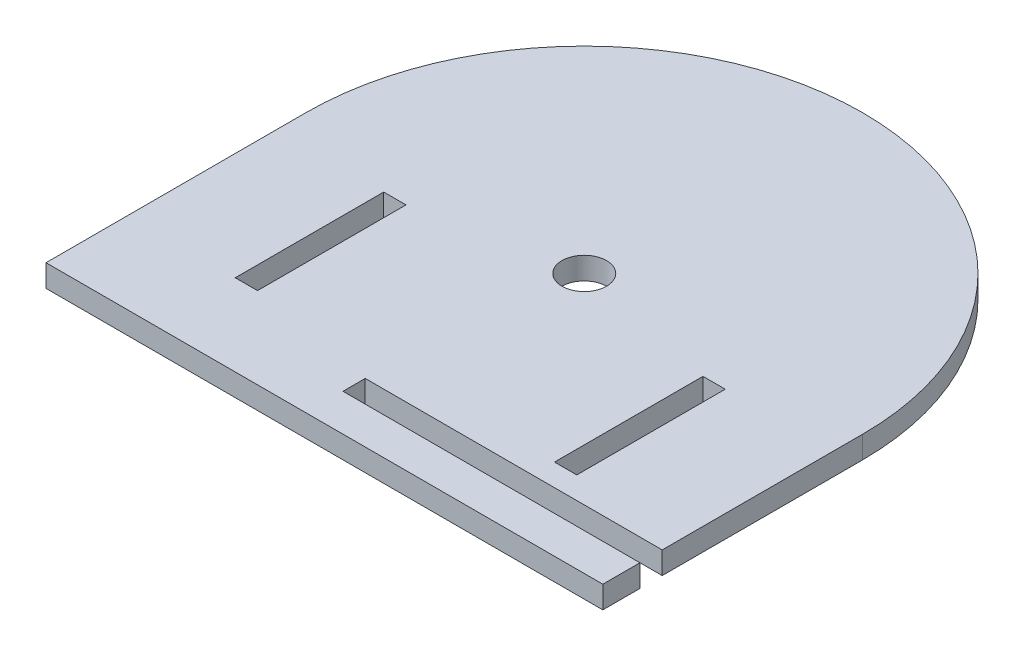
ISO-10303-21;
HEADER;
FILE_DESCRIPTION(('STEP AP214'),'2;1');
FILE_NAME('part.step','',(''),(''),'','','');
FILE_SCHEMA(('AUTOMOTIVE_DESIGN { 1 0 10303 214 1 1 1 1 }'));
ENDSEC;
DATA;
#1=APPLICATION_CONTEXT('core data for automotive mechanical design processes');
#2=APPLICATION_PROTOCOL_DEFINITION('international standard','automotive_design',2000,#1);
#3=PRODUCT_CONTEXT('',#1,'mechanical');
#4=PRODUCT('Part','Part','',(#3));
#5=PRODUCT_RELATED_PRODUCT_CATEGORY('part','',(#4));
#6=PRODUCT_DEFINITION_FORMATION('','',#4);
#7=PRODUCT_DEFINITION_CONTEXT('part definition',#1,'design');
#8=PRODUCT_DEFINITION('design','',#6,#7);
#9=PRODUCT_DEFINITION_SHAPE('','',#8);
#10=(LENGTH_UNIT() NAMED_UNIT(*) SI_UNIT(.MILLI.,.METRE.));
#11=(NAMED_UNIT(*) PLANE_ANGLE_UNIT() SI_UNIT($,.RADIAN.));
#12=(NAMED_UNIT(*) SI_UNIT($,.STERADIAN.) SOLID_ANGLE_UNIT());
#13=UNCERTAINTY_MEASURE_WITH_UNIT(LENGTH_MEASURE(1.E-05),#10,'distance_accuracy_value','');
#14=(GEOMETRIC_REPRESENTATION_CONTEXT(3) GLOBAL_UNCERTAINTY_ASSIGNED_CONTEXT((#13)) GLOBAL_UNIT_ASSIGNED_CONTEXT((#10,
#11,#12)) REPRESENTATION_CONTEXT('',''));
#15=CARTESIAN_POINT('',(0.,0.,0.));
#16=DIRECTION('',(0.,0.,1.));
#17=DIRECTION('',(1.,0.,0.));
#18=AXIS2_PLACEMENT_3D('',#15,#16,#17);
#19=CARTESIAN_POINT('',(0.,3.,-10.9892005622044));
#20=DIRECTION('',(0.,0.,1.));
#21=DIRECTION('',(1.,0.,0.));
#22=AXIS2_PLACEMENT_3D('',#19,#20,#21);
#23=PLANE('',#22);
#24=DIRECTION('',(-1.,0.,0.));
#25=VECTOR('',#24,1.);
#26=CARTESIAN_POINT('',(0.,0.,-10.9892005622044));
#27=LINE('',#26,#25);
#28=CARTESIAN_POINT('',(130.5,0.,-10.9892005622044));
#29=VERTEX_POINT('',#28);
#30=CARTESIAN_POINT('',(127.5,0.,-10.9892005622044));
#31=VERTEX_POINT('',#30);
#32=EDGE_CURVE('E239',#29,#31,#27,.T.);
#33=ORIENTED_EDGE('',*,*,#32,.T.);
#34=DIRECTION('',(0.,-1.,0.));
#35=VECTOR('',#34,1.);
#36=CARTESIAN_POINT('',(127.5,3.,-10.9892005622044));
#37=LINE('',#36,#35);
#38=CARTESIAN_POINT('',(127.5,3.,-10.9892005622044));
#39=VERTEX_POINT('',#38);
#40=EDGE_CURVE('E11',#39,#31,#37,.T.);
#41=ORIENTED_EDGE('',*,*,#40,.F.);
#42=DIRECTION('',(-1.,0.,0.));
#43=VECTOR('',#42,1.);
#44=CARTESIAN_POINT('',(0.,3.,-10.9892005622044));
#45=LINE('',#44,#43);
#46=CARTESIAN_POINT('',(130.5,3.,-10.9892005622044));
#47=VERTEX_POINT('',#46);
#48=EDGE_CURVE('E169',#47,#39,#45,.T.);
#49=ORIENTED_EDGE('',*,*,#48,.F.);
#50=DIRECTION('',(0.,-1.,0.));
#51=VECTOR('',#50,1.);
#52=CARTESIAN_POINT('',(130.5,3.,-10.9892005622044));
#53=LINE('',#52,#51);
#54=EDGE_CURVE('E250',#47,#29,#53,.T.);
#55=ORIENTED_EDGE('',*,*,#54,.T.);
#56=EDGE_LOOP('',(#33,#41,#49,#55));
#57=FACE_BOUND('',#56,.T.);
#58=ADVANCED_FACE('F39',(#57),#23,.F.);
#59=CARTESIAN_POINT('',(127.5,3.,0.));
#60=DIRECTION('',(-1.,0.,0.));
#61=DIRECTION('',(0.,0.,1.));
#62=AXIS2_PLACEMENT_3D('',#59,#60,#61);
#63=PLANE('',#62);
#64=DIRECTION('',(0.,0.,-1.));
#65=VECTOR('',#64,1.);
#66=CARTESIAN_POINT('',(127.5,0.,0.));
#67=LINE('',#66,#65);
#68=CARTESIAN_POINT('',(127.5,0.,-30.9892005622044));
#69=VERTEX_POINT('',#68);
#70=EDGE_CURVE('E175',#31,#69,#67,.T.);
#71=ORIENTED_EDGE('',*,*,#70,.T.);
#72=DIRECTION('',(0.,-1.,0.));
#73=VECTOR('',#72,1.);
#74=CARTESIAN_POINT('',(127.5,3.,-30.9892005622044));
#75=LINE('',#74,#73);
#76=CARTESIAN_POINT('',(127.5,3.,-30.9892005622044));
#77=VERTEX_POINT('',#76);
#78=EDGE_CURVE('E50',#77,#69,#75,.T.);
#79=ORIENTED_EDGE('',*,*,#78,.F.);
#80=DIRECTION('',(0.,0.,-1.));
#81=VECTOR('',#80,1.);
#82=CARTESIAN_POINT('',(127.5,3.,0.));
#83=LINE('',#82,#81);
#84=EDGE_CURVE('E163',#39,#77,#83,.T.);
#85=ORIENTED_EDGE('',*,*,#84,.F.);
#86=ORIENTED_EDGE('',*,*,#40,.T.);
#87=EDGE_LOOP('',(#71,#79,#85,#86));
#88=FACE_BOUND('',#87,.T.);
#89=ADVANCED_FACE('F174',(#88),#63,.F.);
#90=CARTESIAN_POINT('',(0.,3.,-30.9892005622044));
#91=DIRECTION('',(0.,0.,-1.));
#92=DIRECTION('',(-1.,0.,0.));
#93=AXIS2_PLACEMENT_3D('',#90,#91,#92);
#94=PLANE('',#93);
#95=DIRECTION('',(1.,0.,0.));
#96=VECTOR('',#95,1.);
#97=CARTESIAN_POINT('',(0.,0.,-30.9892005622044));
#98=LINE('',#97,#96);
#99=CARTESIAN_POINT('',(130.5,0.,-30.9892005622044));
#100=VERTEX_POINT('',#99);
#101=EDGE_CURVE('E112',#69,#100,#98,.T.);
#102=ORIENTED_EDGE('',*,*,#101,.T.);
#103=DIRECTION('',(0.,-1.,0.));
#104=VECTOR('',#103,1.);
#105=CARTESIAN_POINT('',(130.5,3.,-30.9892005622044));
#106=LINE('',#105,#104);
#107=CARTESIAN_POINT('',(130.5,3.,-30.9892005622044));
#108=VERTEX_POINT('',#107);
#109=EDGE_CURVE('E177',#108,#100,#106,.T.);
#110=ORIENTED_EDGE('',*,*,#109,.F.);
#111=DIRECTION('',(1.,0.,0.));
#112=VECTOR('',#111,1.);
#113=CARTESIAN_POINT('',(0.,3.,-30.9892005622044));
#114=LINE('',#113,#112);
#115=EDGE_CURVE('E167',#77,#108,#114,.T.);
#116=ORIENTED_EDGE('',*,*,#115,.F.);
#117=ORIENTED_EDGE('',*,*,#78,.T.);
#118=EDGE_LOOP('',(#102,#110,#116,#117));
#119=FACE_BOUND('',#118,.T.);
#120=ADVANCED_FACE('F179',(#119),#94,.F.);
#121=CARTESIAN_POINT('',(87.5,3.,0.));
#122=DIRECTION('',(-1.,0.,0.));
#123=DIRECTION('',(0.,0.,1.));
#124=AXIS2_PLACEMENT_3D('',#121,#122,#123);
#125=PLANE('',#124);
#126=DIRECTION('',(0.,0.,-1.));
#127=VECTOR('',#126,1.);
#128=CARTESIAN_POINT('',(87.5,0.,0.));
#129=LINE('',#128,#127);
#130=CARTESIAN_POINT('',(87.5,0.,-10.9892005622043));
#131=VERTEX_POINT('',#130);
#132=CARTESIAN_POINT('',(87.5,0.,-30.9892005622043));
#133=VERTEX_POINT('',#132);
#134=EDGE_CURVE('E223',#131,#133,#129,.T.);
#135=ORIENTED_EDGE('',*,*,#134,.F.);
#136=DIRECTION('',(0.,-1.,0.));
#137=VECTOR('',#136,1.);
#138=CARTESIAN_POINT('',(87.5,3.,-10.9892005622043));
#139=LINE('',#138,#137);
#140=CARTESIAN_POINT('',(87.5,3.,-10.9892005622043));
#141=VERTEX_POINT('',#140);
#142=EDGE_CURVE('E253',#141,#131,#139,.T.);
#143=ORIENTED_EDGE('',*,*,#142,.F.);
#144=DIRECTION('',(0.,0.,-1.));
#145=VECTOR('',#144,1.);
#146=CARTESIAN_POINT('',(87.5,3.,0.));
#147=LINE('',#146,#145);
#148=CARTESIAN_POINT('',(87.5,3.,-30.9892005622043));
#149=VERTEX_POINT('',#148);
#150=EDGE_CURVE('E534',#141,#149,#147,.T.);
#151=ORIENTED_EDGE('',*,*,#150,.T.);
#152=DIRECTION('',(0.,-1.,0.));
#153=VECTOR('',#152,1.);
#154=CARTESIAN_POINT('',(87.5,3.,-30.9892005622043));
#155=LINE('',#154,#153);
#156=EDGE_CURVE('E256',#149,#133,#155,.T.);
#157=ORIENTED_EDGE('',*,*,#156,.T.);
#158=EDGE_LOOP('',(#135,#143,#151,#157));
#159=FACE_BOUND('',#158,.T.);
#160=ADVANCED_FACE('F359',(#159),#125,.T.);
#161=CARTESIAN_POINT('',(0.,3.,-10.9892005622043));
#162=DIRECTION('',(0.,0.,-1.));
#163=DIRECTION('',(-1.,0.,0.));
#164=AXIS2_PLACEMENT_3D('',#161,#162,#163);
#165=PLANE('',#164);
#166=DIRECTION('',(1.,0.,0.));
#167=VECTOR('',#166,1.);
#168=CARTESIAN_POINT('',(0.,0.,-10.9892005622043));
#169=LINE('',#168,#167);
#170=CARTESIAN_POINT('',(84.5,0.,-10.9892005622043));
#171=VERTEX_POINT('',#170);
#172=EDGE_CURVE('E227',#171,#131,#169,.T.);
#173=ORIENTED_EDGE('',*,*,#172,.F.);
#174=DIRECTION('',(0.,-1.,0.));
#175=VECTOR('',#174,1.);
#176=CARTESIAN_POINT('',(84.5,3.,-10.9892005622043));
#177=LINE('',#176,#175);
#178=CARTESIAN_POINT('',(84.5,3.,-10.9892005622043));
#179=VERTEX_POINT('',#178);
#180=EDGE_CURVE('E262',#179,#171,#177,.T.);
#181=ORIENTED_EDGE('',*,*,#180,.F.);
#182=DIRECTION('',(1.,0.,0.));
#183=VECTOR('',#182,1.);
#184=CARTESIAN_POINT('',(0.,3.,-10.9892005622043));
#185=LINE('',#184,#183);
#186=EDGE_CURVE('E537',#179,#141,#185,.T.);
#187=ORIENTED_EDGE('',*,*,#186,.T.);
#188=ORIENTED_EDGE('',*,*,#142,.T.);
#189=EDGE_LOOP('',(#173,#181,#187,#188));
#190=FACE_BOUND('',#189,.T.);
#191=ADVANCED_FACE('F355',(#190),#165,.T.);
#192=CARTESIAN_POINT('',(84.5,3.,0.));
#193=DIRECTION('',(1.,0.,0.));
#194=DIRECTION('',(0.,0.,-1.));
#195=AXIS2_PLACEMENT_3D('',#192,#193,#194);
#196=PLANE('',#195);
#197=DIRECTION('',(0.,0.,1.));
#198=VECTOR('',#197,1.);
#199=CARTESIAN_POINT('',(84.5,0.,0.));
#200=LINE('',#199,#198);
#201=CARTESIAN_POINT('',(84.5,0.,-30.9892005622043));
#202=VERTEX_POINT('',#201);
#203=EDGE_CURVE('E231',#202,#171,#200,.T.);
#204=ORIENTED_EDGE('',*,*,#203,.F.);
#205=DIRECTION('',(0.,-1.,0.));
#206=VECTOR('',#205,1.);
#207=CARTESIAN_POINT('',(84.5,3.,-30.9892005622043));
#208=LINE('',#207,#206);
#209=CARTESIAN_POINT('',(84.5,3.,-30.9892005622043));
#210=VERTEX_POINT('',#209);
#211=EDGE_CURVE('E259',#210,#202,#208,.T.);
#212=ORIENTED_EDGE('',*,*,#211,.F.);
#213=DIRECTION('',(0.,0.,1.));
#214=VECTOR('',#213,1.);
#215=CARTESIAN_POINT('',(84.5,3.,0.));
#216=LINE('',#215,#214);
#217=EDGE_CURVE('E546',#210,#179,#216,.T.);
#218=ORIENTED_EDGE('',*,*,#217,.T.);
#219=ORIENTED_EDGE('',*,*,#180,.T.);
#220=EDGE_LOOP('',(#204,#212,#218,#219));
#221=FACE_BOUND('',#220,.T.);
#222=ADVANCED_FACE('F352',(#221),#196,.T.);
#223=CARTESIAN_POINT('',(107.5,3.,-35.));
#224=DIRECTION('',(0.,-1.,0.));
#225=DIRECTION('',(0.,0.,-1.));
#226=AXIS2_PLACEMENT_3D('',#223,#224,#225);
#227=CYLINDRICAL_SURFACE('',#226,37.5);
#228=CARTESIAN_POINT('',(107.5,0.,-35.));
#229=DIRECTION('',(0.,1.,0.));
#230=DIRECTION('',(0.,0.,1.));
#231=AXIS2_PLACEMENT_3D('',#228,#229,#230);
#232=CIRCLE('',#231,37.5);
#233=CARTESIAN_POINT('',(70.,0.,-35.));
#234=VERTEX_POINT('',#233);
#235=CARTESIAN_POINT('',(145.,0.,-35.));
#236=VERTEX_POINT('',#235);
#237=EDGE_CURVE('E191',#234,#236,#232,.F.);
#238=ORIENTED_EDGE('',*,*,#237,.F.);
#239=DIRECTION('',(0.,-1.,0.));
#240=VECTOR('',#239,1.);
#241=CARTESIAN_POINT('',(70.,3.,-35.));
#242=LINE('',#241,#240);
#243=CARTESIAN_POINT('',(70.,3.,-35.));
#244=VERTEX_POINT('',#243);
#245=EDGE_CURVE('E43',#244,#234,#242,.T.);
#246=ORIENTED_EDGE('',*,*,#245,.F.);
#247=CARTESIAN_POINT('',(107.5,3.,-35.));
#248=DIRECTION('',(0.,1.,0.));
#249=DIRECTION('',(0.,0.,1.));
#250=AXIS2_PLACEMENT_3D('',#247,#248,#249);
#251=CIRCLE('',#250,37.5);
#252=CARTESIAN_POINT('',(145.,3.,-35.));
#253=VERTEX_POINT('',#252);
#254=EDGE_CURVE('E300',#244,#253,#251,.F.);
#255=ORIENTED_EDGE('',*,*,#254,.T.);
#256=DIRECTION('',(0.,-1.,0.));
#257=VECTOR('',#256,1.);
#258=CARTESIAN_POINT('',(145.,3.,-35.));
#259=LINE('',#258,#257);
#260=EDGE_CURVE('E183',#253,#236,#259,.T.);
#261=ORIENTED_EDGE('',*,*,#260,.T.);
#262=EDGE_LOOP('',(#238,#246,#255,#261));
#263=FACE_BOUND('',#262,.T.);
#264=ADVANCED_FACE('F299',(#263),#227,.T.);
#265=CARTESIAN_POINT('',(70.,3.,0.));
#266=DIRECTION('',(1.,0.,0.));
#267=DIRECTION('',(0.,0.,-1.));
#268=AXIS2_PLACEMENT_3D('',#265,#266,#267);
#269=PLANE('',#268);
#270=DIRECTION('',(0.,0.,1.));
#271=VECTOR('',#270,1.);
#272=CARTESIAN_POINT('',(70.,0.,0.));
#273=LINE('',#272,#271);
#274=CARTESIAN_POINT('',(70.,0.,0.));
#275=VERTEX_POINT('',#274);
#276=EDGE_CURVE('E195',#234,#275,#273,.T.);
#277=ORIENTED_EDGE('',*,*,#276,.T.);
#278=DIRECTION('',(0.,-1.,0.));
#279=VECTOR('',#278,1.);
#280=CARTESIAN_POINT('',(70.,3.,0.));
#281=LINE('',#280,#279);
#282=CARTESIAN_POINT('',(70.,3.,0.));
#283=VERTEX_POINT('',#282);
#284=EDGE_CURVE('E283',#283,#275,#281,.T.);
#285=ORIENTED_EDGE('',*,*,#284,.F.);
#286=DIRECTION('',(0.,0.,1.));
#287=VECTOR('',#286,1.);
#288=CARTESIAN_POINT('',(70.,3.,0.));
#289=LINE('',#288,#287);
#290=EDGE_CURVE('E293',#244,#283,#289,.T.);
#291=ORIENTED_EDGE('',*,*,#290,.F.);
#292=ORIENTED_EDGE('',*,*,#245,.T.);
#293=EDGE_LOOP('',(#277,#285,#291,#292));
#294=FACE_BOUND('',#293,.T.);
#295=ADVANCED_FACE('F291',(#294),#269,.F.);
#296=CARTESIAN_POINT('',(0.,3.,0.));
#297=DIRECTION('',(0.,0.,-1.));
#298=DIRECTION('',(-1.,0.,0.));
#299=AXIS2_PLACEMENT_3D('',#296,#297,#298);
#300=PLANE('',#299);
#301=DIRECTION('',(1.,0.,0.));
#302=VECTOR('',#301,1.);
#303=CARTESIAN_POINT('',(0.,0.,0.));
#304=LINE('',#303,#302);
#305=CARTESIAN_POINT('',(145.,0.,0.));
#306=VERTEX_POINT('',#305);
#307=EDGE_CURVE('E199',#275,#306,#304,.T.);
#308=ORIENTED_EDGE('',*,*,#307,.T.);
#309=DIRECTION('',(0.,-1.,0.));
#310=VECTOR('',#309,1.);
#311=CARTESIAN_POINT('',(145.,3.,0.));
#312=LINE('',#311,#310);
#313=CARTESIAN_POINT('',(145.,3.,0.));
#314=VERTEX_POINT('',#313);
#315=EDGE_CURVE('E281',#314,#306,#312,.T.);
#316=ORIENTED_EDGE('',*,*,#315,.F.);
#317=DIRECTION('',(1.,0.,0.));
#318=VECTOR('',#317,1.);
#319=CARTESIAN_POINT('',(0.,3.,0.));
#320=LINE('',#319,#318);
#321=EDGE_CURVE('E569',#283,#314,#320,.T.);
#322=ORIENTED_EDGE('',*,*,#321,.F.);
#323=ORIENTED_EDGE('',*,*,#284,.T.);
#324=EDGE_LOOP('',(#308,#316,#322,#323));
#325=FACE_BOUND('',#324,.T.);
#326=ADVANCED_FACE('F330',(#325),#300,.F.);
#327=CARTESIAN_POINT('',(145.,3.,0.));
#328=DIRECTION('',(1.,0.,0.));
#329=DIRECTION('',(0.,0.,-1.));
#330=AXIS2_PLACEMENT_3D('',#327,#328,#329);
#331=PLANE('',#330);
#332=DIRECTION('',(0.,0.,1.));
#333=VECTOR('',#332,1.);
#334=CARTESIAN_POINT('',(145.,0.,0.));
#335=LINE('',#334,#333);
#336=CARTESIAN_POINT('',(145.,0.,-5.));
#337=VERTEX_POINT('',#336);
#338=EDGE_CURVE('E203',#337,#306,#335,.T.);
#339=ORIENTED_EDGE('',*,*,#338,.F.);
#340=DIRECTION('',(0.,-1.,0.));
#341=VECTOR('',#340,1.);
#342=CARTESIAN_POINT('',(145.,3.,-5.));
#343=LINE('',#342,#341);
#344=CARTESIAN_POINT('',(145.,3.,-5.));
#345=VERTEX_POINT('',#344);
#346=EDGE_CURVE('E278',#345,#337,#343,.T.);
#347=ORIENTED_EDGE('',*,*,#346,.F.);
#348=DIRECTION('',(0.,0.,1.));
#349=VECTOR('',#348,1.);
#350=CARTESIAN_POINT('',(145.,3.,0.));
#351=LINE('',#350,#349);
#352=EDGE_CURVE('E329',#345,#314,#351,.T.);
#353=ORIENTED_EDGE('',*,*,#352,.T.);
#354=ORIENTED_EDGE('',*,*,#315,.T.);
#355=EDGE_LOOP('',(#339,#347,#353,#354));
#356=FACE_BOUND('',#355,.T.);
#357=ADVANCED_FACE('F325',(#356),#331,.T.);
#358=CARTESIAN_POINT('',(0.,3.,-4.99999999999995));
#359=DIRECTION('',(0.,0.,1.));
#360=DIRECTION('',(1.,0.,0.));
#361=AXIS2_PLACEMENT_3D('',#358,#359,#360);
#362=PLANE('',#361);
#363=DIRECTION('',(-1.,0.,0.));
#364=VECTOR('',#363,1.);
#365=CARTESIAN_POINT('',(0.,0.,-4.99999999999995));
#366=LINE('',#365,#364);
#367=CARTESIAN_POINT('',(105.,0.,-4.99999999999998));
#368=VERTEX_POINT('',#367);
#369=EDGE_CURVE('E207',#337,#368,#366,.T.);
#370=ORIENTED_EDGE('',*,*,#369,.T.);
#371=DIRECTION('',(0.,-1.,0.));
#372=VECTOR('',#371,1.);
#373=CARTESIAN_POINT('',(105.,3.,-4.99999999999998));
#374=LINE('',#373,#372);
#375=CARTESIAN_POINT('',(105.,3.,-4.99999999999998));
#376=VERTEX_POINT('',#375);
#377=EDGE_CURVE('E275',#376,#368,#374,.T.);
#378=ORIENTED_EDGE('',*,*,#377,.F.);
#379=DIRECTION('',(-1.,0.,0.));
#380=VECTOR('',#379,1.);
#381=CARTESIAN_POINT('',(0.,3.,-4.99999999999995));
#382=LINE('',#381,#380);
#383=EDGE_CURVE('E564',#345,#376,#382,.T.);
#384=ORIENTED_EDGE('',*,*,#383,.F.);
#385=ORIENTED_EDGE('',*,*,#346,.T.);
#386=EDGE_LOOP('',(#370,#378,#384,#385));
#387=FACE_BOUND('',#386,.T.);
#388=ADVANCED_FACE('F322',(#387),#362,.F.);
#389=CARTESIAN_POINT('',(105.,3.,0.));
#390=DIRECTION('',(1.,0.,0.));
#391=DIRECTION('',(0.,0.,-1.));
#392=AXIS2_PLACEMENT_3D('',#389,#390,#391);
#393=PLANE('',#392);
#394=DIRECTION('',(0.,0.,1.));
#395=VECTOR('',#394,1.);
#396=CARTESIAN_POINT('',(105.,0.,0.));
#397=LINE('',#396,#395);
#398=CARTESIAN_POINT('',(105.,0.,-7.99999999999999));
#399=VERTEX_POINT('',#398);
#400=EDGE_CURVE('E211',#399,#368,#397,.T.);
#401=ORIENTED_EDGE('',*,*,#400,.F.);
#402=DIRECTION('',(0.,-1.,0.));
#403=VECTOR('',#402,1.);
#404=CARTESIAN_POINT('',(105.,3.,-7.99999999999999));
#405=LINE('',#404,#403);
#406=CARTESIAN_POINT('',(105.,3.,-7.99999999999999));
#407=VERTEX_POINT('',#406);
#408=EDGE_CURVE('E272',#407,#399,#405,.T.);
#409=ORIENTED_EDGE('',*,*,#408,.F.);
#410=DIRECTION('',(0.,0.,1.));
#411=VECTOR('',#410,1.);
#412=CARTESIAN_POINT('',(105.,3.,0.));
#413=LINE('',#412,#411);
#414=EDGE_CURVE('E319',#407,#376,#413,.T.);
#415=ORIENTED_EDGE('',*,*,#414,.T.);
#416=ORIENTED_EDGE('',*,*,#377,.T.);
#417=EDGE_LOOP('',(#401,#409,#415,#416));
#418=FACE_BOUND('',#417,.T.);
#419=ADVANCED_FACE('F317',(#418),#393,.T.);
#420=CARTESIAN_POINT('',(0.,3.,-7.99999999999997));
#421=DIRECTION('',(0.,0.,1.));
#422=DIRECTION('',(1.,0.,0.));
#423=AXIS2_PLACEMENT_3D('',#420,#421,#422);
#424=PLANE('',#423);
#425=DIRECTION('',(-1.,0.,0.));
#426=VECTOR('',#425,1.);
#427=CARTESIAN_POINT('',(0.,0.,-7.99999999999997));
#428=LINE('',#427,#426);
#429=CARTESIAN_POINT('',(145.,0.,-7.99999999999999));
#430=VERTEX_POINT('',#429);
#431=EDGE_CURVE('E215',#430,#399,#428,.T.);
#432=ORIENTED_EDGE('',*,*,#431,.F.);
#433=DIRECTION('',(0.,-1.,0.));
#434=VECTOR('',#433,1.);
#435=CARTESIAN_POINT('',(145.,3.,-7.99999999999999));
#436=LINE('',#435,#434);
#437=CARTESIAN_POINT('',(145.,3.,-7.99999999999999));
#438=VERTEX_POINT('',#437);
#439=EDGE_CURVE('E269',#438,#430,#436,.T.);
#440=ORIENTED_EDGE('',*,*,#439,.F.);
#441=DIRECTION('',(-1.,0.,0.));
#442=VECTOR('',#441,1.);
#443=CARTESIAN_POINT('',(0.,3.,-7.99999999999997));
#444=LINE('',#443,#442);
#445=EDGE_CURVE('E313',#438,#407,#444,.T.);
#446=ORIENTED_EDGE('',*,*,#445,.T.);
#447=ORIENTED_EDGE('',*,*,#408,.T.);
#448=EDGE_LOOP('',(#432,#440,#446,#447));
#449=FACE_BOUND('',#448,.T.);
#450=ADVANCED_FACE('F310',(#449),#424,.T.);
#451=CARTESIAN_POINT('',(0.,3.,-30.9892005622043));
#452=DIRECTION('',(0.,0.,1.));
#453=DIRECTION('',(1.,0.,0.));
#454=AXIS2_PLACEMENT_3D('',#451,#452,#453);
#455=PLANE('',#454);
#456=DIRECTION('',(-1.,0.,0.));
#457=VECTOR('',#456,1.);
#458=CARTESIAN_POINT('',(0.,0.,-30.9892005622043));
#459=LINE('',#458,#457);
#460=EDGE_CURVE('E235',#133,#202,#459,.T.);
#461=ORIENTED_EDGE('',*,*,#460,.F.);
#462=ORIENTED_EDGE('',*,*,#156,.F.);
#463=DIRECTION('',(-1.,0.,0.));
#464=VECTOR('',#463,1.);
#465=CARTESIAN_POINT('',(0.,3.,-30.9892005622043));
#466=LINE('',#465,#464);
#467=EDGE_CURVE('E540',#149,#210,#466,.T.);
#468=ORIENTED_EDGE('',*,*,#467,.T.);
#469=ORIENTED_EDGE('',*,*,#211,.T.);
#470=EDGE_LOOP('',(#461,#462,#468,#469));
#471=FACE_BOUND('',#470,.T.);
#472=ADVANCED_FACE('F348',(#471),#455,.T.);
#473=CARTESIAN_POINT('',(145.,3.,0.));
#474=DIRECTION('',(1.,0.,0.));
#475=DIRECTION('',(0.,0.,-1.));
#476=AXIS2_PLACEMENT_3D('',#473,#474,#475);
#477=PLANE('',#476);
#478=DIRECTION('',(0.,0.,1.));
#479=VECTOR('',#478,1.);
#480=CARTESIAN_POINT('',(145.,0.,0.));
#481=LINE('',#480,#479);
#482=EDGE_CURVE('E219',#236,#430,#481,.T.);
#483=ORIENTED_EDGE('',*,*,#482,.F.);
#484=ORIENTED_EDGE('',*,*,#260,.F.);
#485=DIRECTION('',(0.,0.,1.));
#486=VECTOR('',#485,1.);
#487=CARTESIAN_POINT('',(145.,3.,0.));
#488=LINE('',#487,#486);
#489=EDGE_CURVE('E305',#253,#438,#488,.T.);
#490=ORIENTED_EDGE('',*,*,#489,.T.);
#491=ORIENTED_EDGE('',*,*,#439,.T.);
#492=EDGE_LOOP('',(#483,#484,#490,#491));
#493=FACE_BOUND('',#492,.T.);
#494=ADVANCED_FACE('F304',(#493),#477,.T.);
#495=CARTESIAN_POINT('',(107.5,3.,-35.));
#496=DIRECTION('',(0.,-1.,0.));
#497=DIRECTION('',(0.,0.,-1.));
#498=AXIS2_PLACEMENT_3D('',#495,#496,#497);
#499=CYLINDRICAL_SURFACE('',#498,3.00000000000001);
#500=CARTESIAN_POINT('',(107.5,3.,-35.));
#501=DIRECTION('',(0.,1.,0.));
#502=DIRECTION('',(0.,0.,1.));
#503=AXIS2_PLACEMENT_3D('',#500,#501,#502);
#504=CIRCLE('',#503,3.00000000000001);
#505=CARTESIAN_POINT('',(107.5,3.,-32.));
#506=VERTEX_POINT('',#505);
#507=EDGE_CURVE('E249',#506,#506,#504,.T.);
#508=ORIENTED_EDGE('',*,*,#507,.T.);
#509=EDGE_LOOP('',(#508));
#510=FACE_BOUND('',#509,.T.);
#511=CARTESIAN_POINT('',(107.5,0.,-35.));
#512=DIRECTION('',(0.,1.,0.));
#513=DIRECTION('',(0.,0.,1.));
#514=AXIS2_PLACEMENT_3D('',#511,#512,#513);
#515=CIRCLE('',#514,3.00000000000001);
#516=CARTESIAN_POINT('',(107.5,0.,-32.));
#517=VERTEX_POINT('',#516);
#518=EDGE_CURVE('E187',#517,#517,#515,.T.);
#519=ORIENTED_EDGE('',*,*,#518,.F.);
#520=EDGE_LOOP('',(#519));
#521=FACE_BOUND('',#520,.T.);
#522=ADVANCED_FACE('F41',(#510,#521),#499,.F.);
#523=CARTESIAN_POINT('',(130.5,3.,-3.62210261783957E-13));
#524=DIRECTION('',(1.,0.,0.));
#525=DIRECTION('',(0.,0.,-1.));
#526=AXIS2_PLACEMENT_3D('',#523,#524,#525);
#527=PLANE('',#526);
#528=DIRECTION('',(0.,0.,1.));
#529=VECTOR('',#528,1.);
#530=CARTESIAN_POINT('',(130.5,0.,-3.62210261783957E-13));
#531=LINE('',#530,#529);
#532=EDGE_CURVE('E118',#100,#29,#531,.T.);
#533=ORIENTED_EDGE('',*,*,#532,.T.);
#534=ORIENTED_EDGE('',*,*,#54,.F.);
#535=DIRECTION('',(0.,0.,1.));
#536=VECTOR('',#535,1.);
#537=CARTESIAN_POINT('',(130.5,3.,-3.62210261783957E-13));
#538=LINE('',#537,#536);
#539=EDGE_CURVE('E59',#108,#47,#538,.T.);
#540=ORIENTED_EDGE('',*,*,#539,.F.);
#541=ORIENTED_EDGE('',*,*,#109,.T.);
#542=EDGE_LOOP('',(#533,#534,#540,#541));
#543=FACE_BOUND('',#542,.T.);
#544=ADVANCED_FACE('F397',(#543),#527,.F.);
#545=CARTESIAN_POINT('',(0.,3.,0.));
#546=DIRECTION('',(0.,1.,0.));
#547=DIRECTION('',(0.,0.,1.));
#548=AXIS2_PLACEMENT_3D('',#545,#546,#547);
#549=PLANE('',#548);
#550=ORIENTED_EDGE('',*,*,#507,.F.);
#551=EDGE_LOOP('',(#550));
#552=FACE_BOUND('',#551,.T.);
#553=ORIENTED_EDGE('',*,*,#254,.F.);
#554=ORIENTED_EDGE('',*,*,#290,.T.);
#555=ORIENTED_EDGE('',*,*,#321,.T.);
#556=ORIENTED_EDGE('',*,*,#352,.F.);
#557=ORIENTED_EDGE('',*,*,#383,.T.);
#558=ORIENTED_EDGE('',*,*,#414,.F.);
#559=ORIENTED_EDGE('',*,*,#445,.F.);
#560=ORIENTED_EDGE('',*,*,#489,.F.);
#561=EDGE_LOOP('',(#553,#554,#555,#556,#557,#558,#559,#560));
#562=FACE_BOUND('',#561,.T.);
#563=ORIENTED_EDGE('',*,*,#150,.F.);
#564=ORIENTED_EDGE('',*,*,#186,.F.);
#565=ORIENTED_EDGE('',*,*,#217,.F.);
#566=ORIENTED_EDGE('',*,*,#467,.F.);
#567=EDGE_LOOP('',(#563,#564,#565,#566));
#568=FACE_BOUND('',#567,.T.);
#569=ORIENTED_EDGE('',*,*,#48,.T.);
#570=ORIENTED_EDGE('',*,*,#84,.T.);
#571=ORIENTED_EDGE('',*,*,#115,.T.);
#572=ORIENTED_EDGE('',*,*,#539,.T.);
#573=EDGE_LOOP('',(#569,#570,#571,#572));
#574=FACE_BOUND('',#573,.T.);
#575=ADVANCED_FACE('F165',(#552,#562,#568,#574),#549,.T.);
#576=CARTESIAN_POINT('',(0.,0.,0.));
#577=DIRECTION('',(0.,1.,0.));
#578=DIRECTION('',(0.,0.,1.));
#579=AXIS2_PLACEMENT_3D('',#576,#577,#578);
#580=PLANE('',#579);
#581=ORIENTED_EDGE('',*,*,#518,.T.);
#582=EDGE_LOOP('',(#581));
#583=FACE_BOUND('',#582,.T.);
#584=ORIENTED_EDGE('',*,*,#237,.T.);
#585=ORIENTED_EDGE('',*,*,#482,.T.);
#586=ORIENTED_EDGE('',*,*,#431,.T.);
#587=ORIENTED_EDGE('',*,*,#400,.T.);
#588=ORIENTED_EDGE('',*,*,#369,.F.);
#589=ORIENTED_EDGE('',*,*,#338,.T.);
#590=ORIENTED_EDGE('',*,*,#307,.F.);
#591=ORIENTED_EDGE('',*,*,#276,.F.);
#592=EDGE_LOOP('',(#584,#585,#586,#587,#588,#589,#590,#591));
#593=FACE_BOUND('',#592,.T.);
#594=ORIENTED_EDGE('',*,*,#134,.T.);
#595=ORIENTED_EDGE('',*,*,#460,.T.);
#596=ORIENTED_EDGE('',*,*,#203,.T.);
#597=ORIENTED_EDGE('',*,*,#172,.T.);
#598=EDGE_LOOP('',(#594,#595,#596,#597));
#599=FACE_BOUND('',#598,.T.);
#600=ORIENTED_EDGE('',*,*,#32,.F.);
#601=ORIENTED_EDGE('',*,*,#532,.F.);
#602=ORIENTED_EDGE('',*,*,#101,.F.);
#603=ORIENTED_EDGE('',*,*,#70,.F.);
#604=EDGE_LOOP('',(#600,#601,#602,#603));
#605=FACE_BOUND('',#604,.T.);
#606=ADVANCED_FACE('F296',(#583,#593,#599,#605),#580,.F.);
#607=CLOSED_SHELL('',(#58,#89,#120,#160,#191,#222,#264,#295,#326,#357,#388,#419,#450,#472,#494,
#522,#544,#575,#606));
#608=MANIFOLD_SOLID_BREP('B2',#607);
#609=ADVANCED_BREP_SHAPE_REPRESENTATION('',(#18,#608),#14);
#610=SHAPE_DEFINITION_REPRESENTATION(#9,#609);
ENDSEC;
END-ISO-10303-21;
